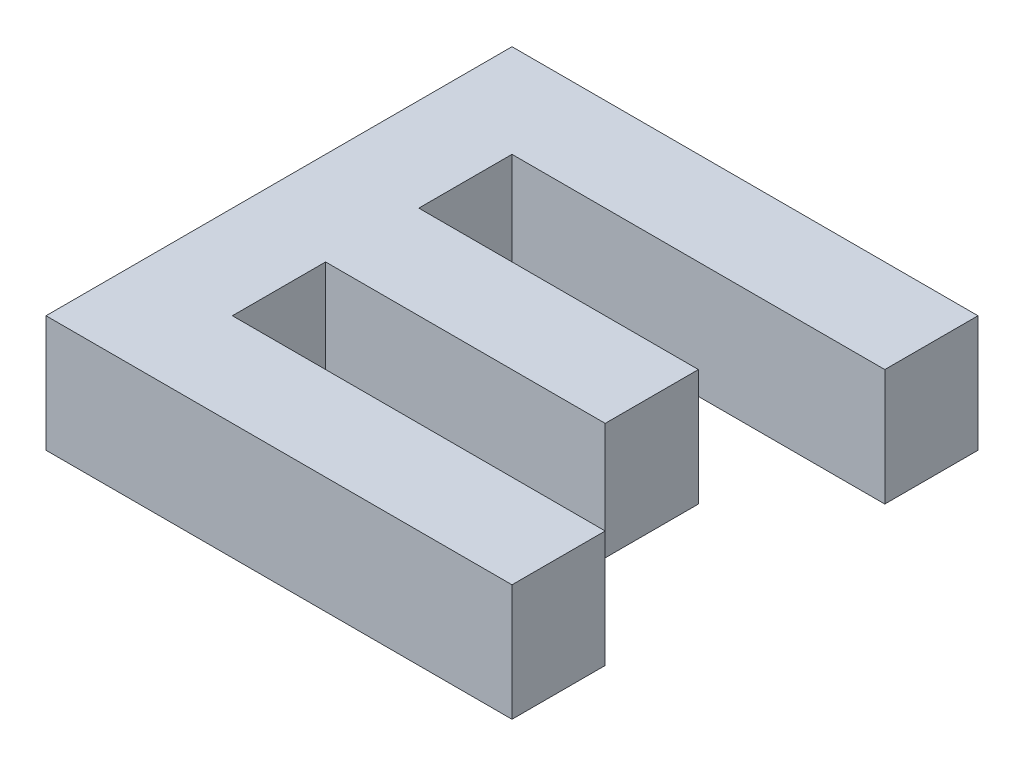
ISO-10303-21;
HEADER;
FILE_DESCRIPTION(('STEP AP214'),'2;1');
FILE_NAME('part.step','',(''),(''),'','','');
FILE_SCHEMA(('AUTOMOTIVE_DESIGN { 1 0 10303 214 1 1 1 1 }'));
ENDSEC;
DATA;
#1=APPLICATION_CONTEXT('core data for automotive mechanical design processes');
#2=APPLICATION_PROTOCOL_DEFINITION('international standard','automotive_design',2000,#1);
#3=PRODUCT_CONTEXT('',#1,'mechanical');
#4=PRODUCT('Part','Part','',(#3));
#5=PRODUCT_RELATED_PRODUCT_CATEGORY('part','',(#4));
#6=PRODUCT_DEFINITION_FORMATION('','',#4);
#7=PRODUCT_DEFINITION_CONTEXT('part definition',#1,'design');
#8=PRODUCT_DEFINITION('design','',#6,#7);
#9=PRODUCT_DEFINITION_SHAPE('','',#8);
#10=(LENGTH_UNIT() NAMED_UNIT(*) SI_UNIT(.MILLI.,.METRE.));
#11=(NAMED_UNIT(*) PLANE_ANGLE_UNIT() SI_UNIT($,.RADIAN.));
#12=(NAMED_UNIT(*) SI_UNIT($,.STERADIAN.) SOLID_ANGLE_UNIT());
#13=UNCERTAINTY_MEASURE_WITH_UNIT(LENGTH_MEASURE(1.E-05),#10,'distance_accuracy_value','');
#14=(GEOMETRIC_REPRESENTATION_CONTEXT(3) GLOBAL_UNCERTAINTY_ASSIGNED_CONTEXT((#13)) GLOBAL_UNIT_ASSIGNED_CONTEXT((#10,
#11,#12)) REPRESENTATION_CONTEXT('',''));
#15=CARTESIAN_POINT('',(0.,0.,0.));
#16=DIRECTION('',(0.,0.,1.));
#17=DIRECTION('',(1.,0.,0.));
#18=AXIS2_PLACEMENT_3D('',#15,#16,#17);
#19=CARTESIAN_POINT('',(200.,10.,0.));
#20=DIRECTION('',(1.,0.,0.));
#21=DIRECTION('',(0.,0.,-1.));
#22=AXIS2_PLACEMENT_3D('',#19,#20,#21);
#23=PLANE('',#22);
#24=DIRECTION('',(0.,0.,1.));
#25=VECTOR('',#24,1.);
#26=CARTESIAN_POINT('',(200.,0.,0.));
#27=LINE('',#26,#25);
#28=CARTESIAN_POINT('',(200.,0.,-40.));
#29=VERTEX_POINT('',#28);
#30=CARTESIAN_POINT('',(200.,0.,0.));
#31=VERTEX_POINT('',#30);
#32=EDGE_CURVE('E153',#29,#31,#27,.T.);
#33=ORIENTED_EDGE('',*,*,#32,.T.);
#34=DIRECTION('',(0.,-1.,0.));
#35=VECTOR('',#34,1.);
#36=CARTESIAN_POINT('',(200.,10.,0.));
#37=LINE('',#36,#35);
#38=CARTESIAN_POINT('',(200.,10.,0.));
#39=VERTEX_POINT('',#38);
#40=EDGE_CURVE('E11',#39,#31,#37,.T.);
#41=ORIENTED_EDGE('',*,*,#40,.F.);
#42=DIRECTION('',(0.,0.,1.));
#43=VECTOR('',#42,1.);
#44=CARTESIAN_POINT('',(200.,10.,0.));
#45=LINE('',#44,#43);
#46=CARTESIAN_POINT('',(200.,10.,-40.));
#47=VERTEX_POINT('',#46);
#48=EDGE_CURVE('E175',#47,#39,#45,.T.);
#49=ORIENTED_EDGE('',*,*,#48,.F.);
#50=DIRECTION('',(0.,-1.,0.));
#51=VECTOR('',#50,1.);
#52=CARTESIAN_POINT('',(200.,10.,-40.));
#53=LINE('',#52,#51);
#54=EDGE_CURVE('E149',#47,#29,#53,.T.);
#55=ORIENTED_EDGE('',*,*,#54,.T.);
#56=EDGE_LOOP('',(#33,#41,#49,#55));
#57=FACE_BOUND('',#56,.T.);
#58=ADVANCED_FACE('F33',(#57),#23,.F.);
#59=CARTESIAN_POINT('',(200.,10.,0.));
#60=DIRECTION('',(0.,0.,-1.));
#61=DIRECTION('',(-1.,0.,0.));
#62=AXIS2_PLACEMENT_3D('',#59,#60,#61);
#63=PLANE('',#62);
#64=DIRECTION('',(1.,0.,0.));
#65=VECTOR('',#64,1.);
#66=CARTESIAN_POINT('',(200.,0.,0.));
#67=LINE('',#66,#65);
#68=CARTESIAN_POINT('',(240.,0.,0.));
#69=VERTEX_POINT('',#68);
#70=EDGE_CURVE('E156',#31,#69,#67,.T.);
#71=ORIENTED_EDGE('',*,*,#70,.T.);
#72=DIRECTION('',(0.,-1.,0.));
#73=VECTOR('',#72,1.);
#74=CARTESIAN_POINT('',(240.,10.,0.));
#75=LINE('',#74,#73);
#76=CARTESIAN_POINT('',(240.,10.,0.));
#77=VERTEX_POINT('',#76);
#78=EDGE_CURVE('E41',#77,#69,#75,.T.);
#79=ORIENTED_EDGE('',*,*,#78,.F.);
#80=DIRECTION('',(1.,0.,0.));
#81=VECTOR('',#80,1.);
#82=CARTESIAN_POINT('',(200.,10.,0.));
#83=LINE('',#82,#81);
#84=EDGE_CURVE('E104',#39,#77,#83,.T.);
#85=ORIENTED_EDGE('',*,*,#84,.F.);
#86=ORIENTED_EDGE('',*,*,#40,.T.);
#87=EDGE_LOOP('',(#71,#79,#85,#86));
#88=FACE_BOUND('',#87,.T.);
#89=ADVANCED_FACE('F253',(#88),#63,.F.);
#90=CARTESIAN_POINT('',(240.,10.,-8.));
#91=DIRECTION('',(-1.,0.,0.));
#92=DIRECTION('',(0.,0.,1.));
#93=AXIS2_PLACEMENT_3D('',#90,#91,#92);
#94=PLANE('',#93);
#95=DIRECTION('',(0.,0.,-1.));
#96=VECTOR('',#95,1.);
#97=CARTESIAN_POINT('',(240.,0.,-8.));
#98=LINE('',#97,#96);
#99=CARTESIAN_POINT('',(240.,0.,-8.));
#100=VERTEX_POINT('',#99);
#101=EDGE_CURVE('E158',#69,#100,#98,.T.);
#102=ORIENTED_EDGE('',*,*,#101,.T.);
#103=DIRECTION('',(0.,-1.,0.));
#104=VECTOR('',#103,1.);
#105=CARTESIAN_POINT('',(240.,10.,-8.));
#106=LINE('',#105,#104);
#107=CARTESIAN_POINT('',(240.,10.,-8.));
#108=VERTEX_POINT('',#107);
#109=EDGE_CURVE('E194',#108,#100,#106,.T.);
#110=ORIENTED_EDGE('',*,*,#109,.F.);
#111=DIRECTION('',(0.,0.,-1.));
#112=VECTOR('',#111,1.);
#113=CARTESIAN_POINT('',(240.,10.,-8.));
#114=LINE('',#113,#112);
#115=EDGE_CURVE('E202',#77,#108,#114,.T.);
#116=ORIENTED_EDGE('',*,*,#115,.F.);
#117=ORIENTED_EDGE('',*,*,#78,.T.);
#118=EDGE_LOOP('',(#102,#110,#116,#117));
#119=FACE_BOUND('',#118,.T.);
#120=ADVANCED_FACE('F200',(#119),#94,.F.);
#121=CARTESIAN_POINT('',(208.,10.,-8.));
#122=DIRECTION('',(0.,0.,1.));
#123=DIRECTION('',(1.,0.,0.));
#124=AXIS2_PLACEMENT_3D('',#121,#122,#123);
#125=PLANE('',#124);
#126=DIRECTION('',(-1.,0.,0.));
#127=VECTOR('',#126,1.);
#128=CARTESIAN_POINT('',(208.,0.,-8.));
#129=LINE('',#128,#127);
#130=CARTESIAN_POINT('',(208.,0.,-8.));
#131=VERTEX_POINT('',#130);
#132=EDGE_CURVE('E160',#100,#131,#129,.T.);
#133=ORIENTED_EDGE('',*,*,#132,.T.);
#134=DIRECTION('',(0.,-1.,0.));
#135=VECTOR('',#134,1.);
#136=CARTESIAN_POINT('',(208.,10.,-8.));
#137=LINE('',#136,#135);
#138=CARTESIAN_POINT('',(208.,10.,-8.));
#139=VERTEX_POINT('',#138);
#140=EDGE_CURVE('E191',#139,#131,#137,.T.);
#141=ORIENTED_EDGE('',*,*,#140,.F.);
#142=DIRECTION('',(-1.,0.,0.));
#143=VECTOR('',#142,1.);
#144=CARTESIAN_POINT('',(208.,10.,-8.));
#145=LINE('',#144,#143);
#146=EDGE_CURVE('E220',#108,#139,#145,.T.);
#147=ORIENTED_EDGE('',*,*,#146,.F.);
#148=ORIENTED_EDGE('',*,*,#109,.T.);
#149=EDGE_LOOP('',(#133,#141,#147,#148));
#150=FACE_BOUND('',#149,.T.);
#151=ADVANCED_FACE('F211',(#150),#125,.F.);
#152=CARTESIAN_POINT('',(208.,10.,-16.));
#153=DIRECTION('',(-1.,0.,0.));
#154=DIRECTION('',(0.,0.,1.));
#155=AXIS2_PLACEMENT_3D('',#152,#153,#154);
#156=PLANE('',#155);
#157=DIRECTION('',(0.,0.,-1.));
#158=VECTOR('',#157,1.);
#159=CARTESIAN_POINT('',(208.,0.,-16.));
#160=LINE('',#159,#158);
#161=CARTESIAN_POINT('',(208.,0.,-16.));
#162=VERTEX_POINT('',#161);
#163=EDGE_CURVE('E162',#131,#162,#160,.T.);
#164=ORIENTED_EDGE('',*,*,#163,.T.);
#165=DIRECTION('',(0.,-1.,0.));
#166=VECTOR('',#165,1.);
#167=CARTESIAN_POINT('',(208.,10.,-16.));
#168=LINE('',#167,#166);
#169=CARTESIAN_POINT('',(208.,10.,-16.));
#170=VERTEX_POINT('',#169);
#171=EDGE_CURVE('E188',#170,#162,#168,.T.);
#172=ORIENTED_EDGE('',*,*,#171,.F.);
#173=DIRECTION('',(0.,0.,-1.));
#174=VECTOR('',#173,1.);
#175=CARTESIAN_POINT('',(208.,10.,-16.));
#176=LINE('',#175,#174);
#177=EDGE_CURVE('E217',#139,#170,#176,.T.);
#178=ORIENTED_EDGE('',*,*,#177,.F.);
#179=ORIENTED_EDGE('',*,*,#140,.T.);
#180=EDGE_LOOP('',(#164,#172,#178,#179));
#181=FACE_BOUND('',#180,.T.);
#182=ADVANCED_FACE('F215',(#181),#156,.F.);
#183=CARTESIAN_POINT('',(232.,10.,-16.));
#184=DIRECTION('',(0.,0.,-1.));
#185=DIRECTION('',(-1.,0.,0.));
#186=AXIS2_PLACEMENT_3D('',#183,#184,#185);
#187=PLANE('',#186);
#188=DIRECTION('',(1.,0.,0.));
#189=VECTOR('',#188,1.);
#190=CARTESIAN_POINT('',(232.,0.,-16.));
#191=LINE('',#190,#189);
#192=CARTESIAN_POINT('',(232.,0.,-16.));
#193=VERTEX_POINT('',#192);
#194=EDGE_CURVE('E164',#162,#193,#191,.T.);
#195=ORIENTED_EDGE('',*,*,#194,.T.);
#196=DIRECTION('',(0.,-1.,0.));
#197=VECTOR('',#196,1.);
#198=CARTESIAN_POINT('',(232.,10.,-16.));
#199=LINE('',#198,#197);
#200=CARTESIAN_POINT('',(232.,10.,-16.));
#201=VERTEX_POINT('',#200);
#202=EDGE_CURVE('E185',#201,#193,#199,.T.);
#203=ORIENTED_EDGE('',*,*,#202,.F.);
#204=DIRECTION('',(1.,0.,0.));
#205=VECTOR('',#204,1.);
#206=CARTESIAN_POINT('',(232.,10.,-16.));
#207=LINE('',#206,#205);
#208=EDGE_CURVE('E219',#170,#201,#207,.T.);
#209=ORIENTED_EDGE('',*,*,#208,.F.);
#210=ORIENTED_EDGE('',*,*,#171,.T.);
#211=EDGE_LOOP('',(#195,#203,#209,#210));
#212=FACE_BOUND('',#211,.T.);
#213=ADVANCED_FACE('F266',(#212),#187,.F.);
#214=CARTESIAN_POINT('',(232.,10.,-24.));
#215=DIRECTION('',(-1.,0.,0.));
#216=DIRECTION('',(0.,0.,1.));
#217=AXIS2_PLACEMENT_3D('',#214,#215,#216);
#218=PLANE('',#217);
#219=DIRECTION('',(0.,0.,-1.));
#220=VECTOR('',#219,1.);
#221=CARTESIAN_POINT('',(232.,0.,-24.));
#222=LINE('',#221,#220);
#223=CARTESIAN_POINT('',(232.,0.,-24.));
#224=VERTEX_POINT('',#223);
#225=EDGE_CURVE('E166',#193,#224,#222,.T.);
#226=ORIENTED_EDGE('',*,*,#225,.T.);
#227=DIRECTION('',(0.,-1.,0.));
#228=VECTOR('',#227,1.);
#229=CARTESIAN_POINT('',(232.,10.,-24.));
#230=LINE('',#229,#228);
#231=CARTESIAN_POINT('',(232.,10.,-24.));
#232=VERTEX_POINT('',#231);
#233=EDGE_CURVE('E182',#232,#224,#230,.T.);
#234=ORIENTED_EDGE('',*,*,#233,.F.);
#235=DIRECTION('',(0.,0.,-1.));
#236=VECTOR('',#235,1.);
#237=CARTESIAN_POINT('',(232.,10.,-24.));
#238=LINE('',#237,#236);
#239=EDGE_CURVE('E222',#201,#232,#238,.T.);
#240=ORIENTED_EDGE('',*,*,#239,.F.);
#241=ORIENTED_EDGE('',*,*,#202,.T.);
#242=EDGE_LOOP('',(#226,#234,#240,#241));
#243=FACE_BOUND('',#242,.T.);
#244=ADVANCED_FACE('F269',(#243),#218,.F.);
#245=CARTESIAN_POINT('',(208.,10.,-24.));
#246=DIRECTION('',(0.,0.,1.));
#247=DIRECTION('',(1.,0.,0.));
#248=AXIS2_PLACEMENT_3D('',#245,#246,#247);
#249=PLANE('',#248);
#250=DIRECTION('',(-1.,0.,0.));
#251=VECTOR('',#250,1.);
#252=CARTESIAN_POINT('',(208.,0.,-24.));
#253=LINE('',#252,#251);
#254=CARTESIAN_POINT('',(208.,0.,-24.));
#255=VERTEX_POINT('',#254);
#256=EDGE_CURVE('E168',#224,#255,#253,.T.);
#257=ORIENTED_EDGE('',*,*,#256,.T.);
#258=DIRECTION('',(0.,-1.,0.));
#259=VECTOR('',#258,1.);
#260=CARTESIAN_POINT('',(208.,10.,-24.));
#261=LINE('',#260,#259);
#262=CARTESIAN_POINT('',(208.,10.,-24.));
#263=VERTEX_POINT('',#262);
#264=EDGE_CURVE('E179',#263,#255,#261,.T.);
#265=ORIENTED_EDGE('',*,*,#264,.F.);
#266=DIRECTION('',(-1.,0.,0.));
#267=VECTOR('',#266,1.);
#268=CARTESIAN_POINT('',(208.,10.,-24.));
#269=LINE('',#268,#267);
#270=EDGE_CURVE('E228',#232,#263,#269,.T.);
#271=ORIENTED_EDGE('',*,*,#270,.F.);
#272=ORIENTED_EDGE('',*,*,#233,.T.);
#273=EDGE_LOOP('',(#257,#265,#271,#272));
#274=FACE_BOUND('',#273,.T.);
#275=ADVANCED_FACE('F234',(#274),#249,.F.);
#276=CARTESIAN_POINT('',(208.,10.,-32.));
#277=DIRECTION('',(-1.,0.,0.));
#278=DIRECTION('',(0.,0.,1.));
#279=AXIS2_PLACEMENT_3D('',#276,#277,#278);
#280=PLANE('',#279);
#281=DIRECTION('',(0.,0.,-1.));
#282=VECTOR('',#281,1.);
#283=CARTESIAN_POINT('',(208.,0.,-32.));
#284=LINE('',#283,#282);
#285=CARTESIAN_POINT('',(208.,0.,-32.));
#286=VERTEX_POINT('',#285);
#287=EDGE_CURVE('E170',#255,#286,#284,.T.);
#288=ORIENTED_EDGE('',*,*,#287,.T.);
#289=DIRECTION('',(0.,-1.,0.));
#290=VECTOR('',#289,1.);
#291=CARTESIAN_POINT('',(208.,10.,-32.));
#292=LINE('',#291,#290);
#293=CARTESIAN_POINT('',(208.,10.,-32.));
#294=VERTEX_POINT('',#293);
#295=EDGE_CURVE('E144',#294,#286,#292,.T.);
#296=ORIENTED_EDGE('',*,*,#295,.F.);
#297=DIRECTION('',(0.,0.,-1.));
#298=VECTOR('',#297,1.);
#299=CARTESIAN_POINT('',(208.,10.,-32.));
#300=LINE('',#299,#298);
#301=EDGE_CURVE('E135',#263,#294,#300,.T.);
#302=ORIENTED_EDGE('',*,*,#301,.F.);
#303=ORIENTED_EDGE('',*,*,#264,.T.);
#304=EDGE_LOOP('',(#288,#296,#302,#303));
#305=FACE_BOUND('',#304,.T.);
#306=ADVANCED_FACE('F238',(#305),#280,.F.);
#307=CARTESIAN_POINT('',(240.,10.,-32.));
#308=DIRECTION('',(0.,0.,-1.));
#309=DIRECTION('',(-1.,0.,0.));
#310=AXIS2_PLACEMENT_3D('',#307,#308,#309);
#311=PLANE('',#310);
#312=DIRECTION('',(1.,0.,0.));
#313=VECTOR('',#312,1.);
#314=CARTESIAN_POINT('',(240.,0.,-32.));
#315=LINE('',#314,#313);
#316=CARTESIAN_POINT('',(240.,0.,-32.));
#317=VERTEX_POINT('',#316);
#318=EDGE_CURVE('E143',#286,#317,#315,.T.);
#319=ORIENTED_EDGE('',*,*,#318,.T.);
#320=DIRECTION('',(0.,-1.,0.));
#321=VECTOR('',#320,1.);
#322=CARTESIAN_POINT('',(240.,10.,-32.));
#323=LINE('',#322,#321);
#324=CARTESIAN_POINT('',(240.,10.,-32.));
#325=VERTEX_POINT('',#324);
#326=EDGE_CURVE('E140',#325,#317,#323,.T.);
#327=ORIENTED_EDGE('',*,*,#326,.F.);
#328=DIRECTION('',(1.,0.,0.));
#329=VECTOR('',#328,1.);
#330=CARTESIAN_POINT('',(240.,10.,-32.));
#331=LINE('',#330,#329);
#332=EDGE_CURVE('E129',#294,#325,#331,.T.);
#333=ORIENTED_EDGE('',*,*,#332,.F.);
#334=ORIENTED_EDGE('',*,*,#295,.T.);
#335=EDGE_LOOP('',(#319,#327,#333,#334));
#336=FACE_BOUND('',#335,.T.);
#337=ADVANCED_FACE('F141',(#336),#311,.F.);
#338=CARTESIAN_POINT('',(240.,10.,-40.));
#339=DIRECTION('',(-1.,0.,0.));
#340=DIRECTION('',(0.,0.,1.));
#341=AXIS2_PLACEMENT_3D('',#338,#339,#340);
#342=PLANE('',#341);
#343=DIRECTION('',(0.,0.,-1.));
#344=VECTOR('',#343,1.);
#345=CARTESIAN_POINT('',(240.,0.,-40.));
#346=LINE('',#345,#344);
#347=CARTESIAN_POINT('',(240.,0.,-40.));
#348=VERTEX_POINT('',#347);
#349=EDGE_CURVE('E90',#317,#348,#346,.T.);
#350=ORIENTED_EDGE('',*,*,#349,.T.);
#351=DIRECTION('',(0.,-1.,0.));
#352=VECTOR('',#351,1.);
#353=CARTESIAN_POINT('',(240.,10.,-40.));
#354=LINE('',#353,#352);
#355=CARTESIAN_POINT('',(240.,10.,-40.));
#356=VERTEX_POINT('',#355);
#357=EDGE_CURVE('E145',#356,#348,#354,.T.);
#358=ORIENTED_EDGE('',*,*,#357,.F.);
#359=DIRECTION('',(0.,0.,-1.));
#360=VECTOR('',#359,1.);
#361=CARTESIAN_POINT('',(240.,10.,-40.));
#362=LINE('',#361,#360);
#363=EDGE_CURVE('E133',#325,#356,#362,.T.);
#364=ORIENTED_EDGE('',*,*,#363,.F.);
#365=ORIENTED_EDGE('',*,*,#326,.T.);
#366=EDGE_LOOP('',(#350,#358,#364,#365));
#367=FACE_BOUND('',#366,.T.);
#368=ADVANCED_FACE('F147',(#367),#342,.F.);
#369=CARTESIAN_POINT('',(200.,10.,-40.));
#370=DIRECTION('',(0.,0.,1.));
#371=DIRECTION('',(1.,0.,0.));
#372=AXIS2_PLACEMENT_3D('',#369,#370,#371);
#373=PLANE('',#372);
#374=DIRECTION('',(-1.,0.,0.));
#375=VECTOR('',#374,1.);
#376=CARTESIAN_POINT('',(200.,0.,-40.));
#377=LINE('',#376,#375);
#378=EDGE_CURVE('E96',#348,#29,#377,.T.);
#379=ORIENTED_EDGE('',*,*,#378,.T.);
#380=ORIENTED_EDGE('',*,*,#54,.F.);
#381=DIRECTION('',(-1.,0.,0.));
#382=VECTOR('',#381,1.);
#383=CARTESIAN_POINT('',(200.,10.,-40.));
#384=LINE('',#383,#382);
#385=EDGE_CURVE('E49',#356,#47,#384,.T.);
#386=ORIENTED_EDGE('',*,*,#385,.F.);
#387=ORIENTED_EDGE('',*,*,#357,.T.);
#388=EDGE_LOOP('',(#379,#380,#386,#387));
#389=FACE_BOUND('',#388,.T.);
#390=ADVANCED_FACE('F242',(#389),#373,.F.);
#391=CARTESIAN_POINT('',(0.,10.,0.));
#392=DIRECTION('',(0.,-1.,0.));
#393=DIRECTION('',(0.,0.,-1.));
#394=AXIS2_PLACEMENT_3D('',#391,#392,#393);
#395=PLANE('',#394);
#396=ORIENTED_EDGE('',*,*,#48,.T.);
#397=ORIENTED_EDGE('',*,*,#84,.T.);
#398=ORIENTED_EDGE('',*,*,#115,.T.);
#399=ORIENTED_EDGE('',*,*,#146,.T.);
#400=ORIENTED_EDGE('',*,*,#177,.T.);
#401=ORIENTED_EDGE('',*,*,#208,.T.);
#402=ORIENTED_EDGE('',*,*,#239,.T.);
#403=ORIENTED_EDGE('',*,*,#270,.T.);
#404=ORIENTED_EDGE('',*,*,#301,.T.);
#405=ORIENTED_EDGE('',*,*,#332,.T.);
#406=ORIENTED_EDGE('',*,*,#363,.T.);
#407=ORIENTED_EDGE('',*,*,#385,.T.);
#408=EDGE_LOOP('',(#396,#397,#398,#399,#400,#401,#402,#403,#404,#405,#406,#407));
#409=FACE_BOUND('',#408,.T.);
#410=ADVANCED_FACE('F131',(#409),#395,.F.);
#411=CARTESIAN_POINT('',(0.,0.,0.));
#412=DIRECTION('',(0.,-1.,0.));
#413=DIRECTION('',(0.,0.,-1.));
#414=AXIS2_PLACEMENT_3D('',#411,#412,#413);
#415=PLANE('',#414);
#416=ORIENTED_EDGE('',*,*,#32,.F.);
#417=ORIENTED_EDGE('',*,*,#378,.F.);
#418=ORIENTED_EDGE('',*,*,#349,.F.);
#419=ORIENTED_EDGE('',*,*,#318,.F.);
#420=ORIENTED_EDGE('',*,*,#287,.F.);
#421=ORIENTED_EDGE('',*,*,#256,.F.);
#422=ORIENTED_EDGE('',*,*,#225,.F.);
#423=ORIENTED_EDGE('',*,*,#194,.F.);
#424=ORIENTED_EDGE('',*,*,#163,.F.);
#425=ORIENTED_EDGE('',*,*,#132,.F.);
#426=ORIENTED_EDGE('',*,*,#101,.F.);
#427=ORIENTED_EDGE('',*,*,#70,.F.);
#428=EDGE_LOOP('',(#416,#417,#418,#419,#420,#421,#422,#423,#424,#425,#426,#427));
#429=FACE_BOUND('',#428,.T.);
#430=ADVANCED_FACE('F206',(#429),#415,.T.);
#431=CLOSED_SHELL('',(#58,#89,#120,#151,#182,#213,#244,#275,#306,#337,#368,#390,#410,#430));
#432=MANIFOLD_SOLID_BREP('B2',#431);
#433=ADVANCED_BREP_SHAPE_REPRESENTATION('',(#18,#432),#14);
#434=SHAPE_DEFINITION_REPRESENTATION(#9,#433);
ENDSEC;
END-ISO-10303-21;
